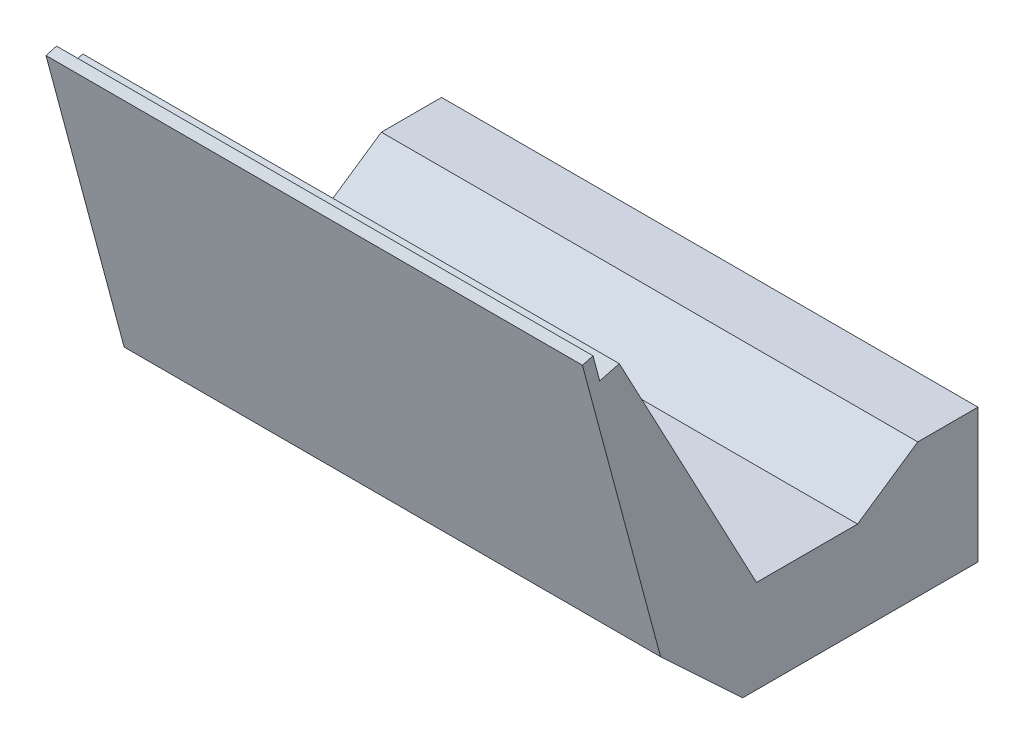
ISO-10303-21;
HEADER;
FILE_DESCRIPTION(('STEP AP214'),'2;1');
FILE_NAME('part.step','',(''),(''),'','','');
FILE_SCHEMA(('AUTOMOTIVE_DESIGN { 1 0 10303 214 1 1 1 1 }'));
ENDSEC;
DATA;
#1=APPLICATION_CONTEXT('core data for automotive mechanical design processes');
#2=APPLICATION_PROTOCOL_DEFINITION('international standard','automotive_design',2000,#1);
#3=PRODUCT_CONTEXT('',#1,'mechanical');
#4=PRODUCT('Part','Part','',(#3));
#5=PRODUCT_RELATED_PRODUCT_CATEGORY('part','',(#4));
#6=PRODUCT_DEFINITION_FORMATION('','',#4);
#7=PRODUCT_DEFINITION_CONTEXT('part definition',#1,'design');
#8=PRODUCT_DEFINITION('design','',#6,#7);
#9=PRODUCT_DEFINITION_SHAPE('','',#8);
#10=(LENGTH_UNIT() NAMED_UNIT(*) SI_UNIT(.MILLI.,.METRE.));
#11=(NAMED_UNIT(*) PLANE_ANGLE_UNIT() SI_UNIT($,.RADIAN.));
#12=(NAMED_UNIT(*) SI_UNIT($,.STERADIAN.) SOLID_ANGLE_UNIT());
#13=UNCERTAINTY_MEASURE_WITH_UNIT(LENGTH_MEASURE(1.E-05),#10,'distance_accuracy_value','');
#14=(GEOMETRIC_REPRESENTATION_CONTEXT(3) GLOBAL_UNCERTAINTY_ASSIGNED_CONTEXT((#13)) GLOBAL_UNIT_ASSIGNED_CONTEXT((#10,
#11,#12)) REPRESENTATION_CONTEXT('',''));
#15=CARTESIAN_POINT('',(0.,0.,0.));
#16=DIRECTION('',(0.,0.,1.));
#17=DIRECTION('',(1.,0.,0.));
#18=AXIS2_PLACEMENT_3D('',#15,#16,#17);
#19=CARTESIAN_POINT('',(49.,6.51622002820874,4.4428772919605));
#20=DIRECTION('',(0.,-0.826227342807548,-0.56333682464151));
#21=DIRECTION('',(0.,0.56333682464151,-0.826227342807548));
#22=AXIS2_PLACEMENT_3D('',#19,#20,#21);
#23=PLANE('',#22);
#24=DIRECTION('',(0.,-0.56333682464151,0.826227342807548));
#25=VECTOR('',#24,1.);
#26=CARTESIAN_POINT('',(-49.,6.51622002820874,4.4428772919605));
#27=LINE('',#26,#25);
#28=CARTESIAN_POINT('',(-49.,7.50000000000001,2.99999999999998));
#29=VERTEX_POINT('',#28);
#30=CARTESIAN_POINT('',(-49.,0.,14.));
#31=VERTEX_POINT('',#30);
#32=EDGE_CURVE('E153',#29,#31,#27,.T.);
#33=ORIENTED_EDGE('',*,*,#32,.T.);
#34=DIRECTION('',(-1.,0.,0.));
#35=VECTOR('',#34,1.);
#36=CARTESIAN_POINT('',(49.,0.,14.));
#37=LINE('',#36,#35);
#38=CARTESIAN_POINT('',(49.,0.,14.));
#39=VERTEX_POINT('',#38);
#40=EDGE_CURVE('E11',#39,#31,#37,.T.);
#41=ORIENTED_EDGE('',*,*,#40,.F.);
#42=DIRECTION('',(0.,-0.56333682464151,0.826227342807548));
#43=VECTOR('',#42,1.);
#44=CARTESIAN_POINT('',(49.,6.51622002820874,4.4428772919605));
#45=LINE('',#44,#43);
#46=CARTESIAN_POINT('',(49.,7.50000000000001,2.99999999999998));
#47=VERTEX_POINT('',#46);
#48=EDGE_CURVE('E179',#47,#39,#45,.T.);
#49=ORIENTED_EDGE('',*,*,#48,.F.);
#50=DIRECTION('',(-1.,0.,0.));
#51=VECTOR('',#50,1.);
#52=CARTESIAN_POINT('',(49.,7.50000000000001,2.99999999999998));
#53=LINE('',#52,#51);
#54=EDGE_CURVE('E152',#47,#29,#53,.T.);
#55=ORIENTED_EDGE('',*,*,#54,.T.);
#56=EDGE_LOOP('',(#33,#41,#49,#55));
#57=FACE_BOUND('',#56,.T.);
#58=ADVANCED_FACE('F38',(#57),#23,.F.);
#59=CARTESIAN_POINT('',(49.,0.,0.));
#60=DIRECTION('',(0.,-1.,0.));
#61=DIRECTION('',(0.,0.,-1.));
#62=AXIS2_PLACEMENT_3D('',#59,#60,#61);
#63=PLANE('',#62);
#64=DIRECTION('',(0.,0.,1.));
#65=VECTOR('',#64,1.);
#66=CARTESIAN_POINT('',(-49.,0.,0.));
#67=LINE('',#66,#65);
#68=CARTESIAN_POINT('',(-49.,0.,32.4672536867458));
#69=VERTEX_POINT('',#68);
#70=EDGE_CURVE('E156',#31,#69,#67,.T.);
#71=ORIENTED_EDGE('',*,*,#70,.T.);
#72=DIRECTION('',(-1.,0.,0.));
#73=VECTOR('',#72,1.);
#74=CARTESIAN_POINT('',(49.,0.,32.4672536867458));
#75=LINE('',#74,#73);
#76=CARTESIAN_POINT('',(49.,0.,32.4672536867458));
#77=VERTEX_POINT('',#76);
#78=EDGE_CURVE('E46',#77,#69,#75,.T.);
#79=ORIENTED_EDGE('',*,*,#78,.F.);
#80=DIRECTION('',(0.,0.,1.));
#81=VECTOR('',#80,1.);
#82=CARTESIAN_POINT('',(49.,0.,0.));
#83=LINE('',#82,#81);
#84=EDGE_CURVE('E105',#39,#77,#83,.T.);
#85=ORIENTED_EDGE('',*,*,#84,.F.);
#86=ORIENTED_EDGE('',*,*,#40,.T.);
#87=EDGE_LOOP('',(#71,#79,#85,#86));
#88=FACE_BOUND('',#87,.T.);
#89=ADVANCED_FACE('F199',(#88),#63,.F.);
#90=CARTESIAN_POINT('',(49.,-13.458286591994,25.3113557717795));
#91=DIRECTION('',(0.,0.469471562785882,-0.882947592858932));
#92=DIRECTION('',(0.,0.882947592858932,0.469471562785882));
#93=AXIS2_PLACEMENT_3D('',#90,#91,#92);
#94=PLANE('',#93);
#95=DIRECTION('',(0.,-0.882947592858932,-0.469471562785882));
#96=VECTOR('',#95,1.);
#97=CARTESIAN_POINT('',(-49.,-13.458286591994,25.3113557717795));
#98=LINE('',#97,#96);
#99=CARTESIAN_POINT('',(-49.,47.1501693405449,57.5374434295488));
#100=VERTEX_POINT('',#99);
#101=EDGE_CURVE('E159',#100,#69,#98,.T.);
#102=ORIENTED_EDGE('',*,*,#101,.F.);
#103=DIRECTION('',(-1.,0.,0.));
#104=VECTOR('',#103,1.);
#105=CARTESIAN_POINT('',(49.,47.1501693405449,57.5374434295488));
#106=LINE('',#105,#104);
#107=CARTESIAN_POINT('',(49.,47.1501693405449,57.5374434295488));
#108=VERTEX_POINT('',#107);
#109=EDGE_CURVE('E192',#108,#100,#106,.T.);
#110=ORIENTED_EDGE('',*,*,#109,.F.);
#111=DIRECTION('',(0.,-0.882947592858932,-0.469471562785882));
#112=VECTOR('',#111,1.);
#113=CARTESIAN_POINT('',(49.,-13.458286591994,25.3113557717795));
#114=LINE('',#113,#112);
#115=EDGE_CURVE('E198',#108,#77,#114,.T.);
#116=ORIENTED_EDGE('',*,*,#115,.T.);
#117=ORIENTED_EDGE('',*,*,#78,.T.);
#118=EDGE_LOOP('',(#102,#110,#116,#117));
#119=FACE_BOUND('',#118,.T.);
#120=ADVANCED_FACE('F196',(#119),#94,.T.);
#121=CARTESIAN_POINT('',(49.,58.3760677484846,15.6418202105109));
#122=DIRECTION('',(0.,0.965925826289069,0.25881904510252));
#123=DIRECTION('',(0.,-0.25881904510252,0.965925826289069));
#124=AXIS2_PLACEMENT_3D('',#121,#122,#123);
#125=PLANE('',#124);
#126=DIRECTION('',(0.,0.25881904510252,-0.965925826289069));
#127=VECTOR('',#126,1.);
#128=CARTESIAN_POINT('',(-49.,58.3760677484846,15.6418202105109));
#129=LINE('',#128,#127);
#130=CARTESIAN_POINT('',(-49.,46.1947859176464,61.102982904515));
#131=VERTEX_POINT('',#130);
#132=EDGE_CURVE('E162',#131,#100,#129,.T.);
#133=ORIENTED_EDGE('',*,*,#132,.F.);
#134=DIRECTION('',(-1.,0.,0.));
#135=VECTOR('',#134,1.);
#136=CARTESIAN_POINT('',(49.,46.1947859176464,61.102982904515));
#137=LINE('',#136,#135);
#138=CARTESIAN_POINT('',(49.,46.1947859176464,61.102982904515));
#139=VERTEX_POINT('',#138);
#140=EDGE_CURVE('E190',#139,#131,#137,.T.);
#141=ORIENTED_EDGE('',*,*,#140,.F.);
#142=DIRECTION('',(0.,0.25881904510252,-0.965925826289069));
#143=VECTOR('',#142,1.);
#144=CARTESIAN_POINT('',(49.,58.3760677484846,15.6418202105109));
#145=LINE('',#144,#143);
#146=EDGE_CURVE('E210',#139,#108,#145,.T.);
#147=ORIENTED_EDGE('',*,*,#146,.T.);
#148=ORIENTED_EDGE('',*,*,#109,.T.);
#149=EDGE_LOOP('',(#133,#141,#147,#148));
#150=FACE_BOUND('',#149,.T.);
#151=ADVANCED_FACE('F207',(#150),#125,.T.);
#152=CARTESIAN_POINT('',(49.,-12.1812818308383,45.4611626940041));
#153=DIRECTION('',(0.,0.258819045102521,-0.965925826289068));
#154=DIRECTION('',(0.,0.965925826289068,0.258819045102521));
#155=AXIS2_PLACEMENT_3D('',#152,#153,#154);
#156=PLANE('',#155);
#157=DIRECTION('',(0.,-0.965925826289068,-0.258819045102521));
#158=VECTOR('',#157,1.);
#159=CARTESIAN_POINT('',(-49.,-12.1812818308383,45.4611626940041));
#160=LINE('',#159,#158);
#161=CARTESIAN_POINT('',(-49.,50.7829335925196,62.332373368752));
#162=VERTEX_POINT('',#161);
#163=EDGE_CURVE('E165',#162,#131,#160,.T.);
#164=ORIENTED_EDGE('',*,*,#163,.F.);
#165=DIRECTION('',(-1.,0.,0.));
#166=VECTOR('',#165,1.);
#167=CARTESIAN_POINT('',(49.,50.7829335925196,62.332373368752));
#168=LINE('',#167,#166);
#169=CARTESIAN_POINT('',(49.,50.7829335925196,62.332373368752));
#170=VERTEX_POINT('',#169);
#171=EDGE_CURVE('E188',#170,#162,#168,.T.);
#172=ORIENTED_EDGE('',*,*,#171,.F.);
#173=DIRECTION('',(0.,-0.965925826289068,-0.258819045102521));
#174=VECTOR('',#173,1.);
#175=CARTESIAN_POINT('',(49.,-12.1812818308383,45.4611626940041));
#176=LINE('',#175,#174);
#177=EDGE_CURVE('E214',#170,#139,#176,.T.);
#178=ORIENTED_EDGE('',*,*,#177,.T.);
#179=ORIENTED_EDGE('',*,*,#140,.T.);
#180=EDGE_LOOP('',(#164,#172,#178,#179));
#181=FACE_BOUND('',#180,.T.);
#182=ADVANCED_FACE('F254',(#181),#156,.T.);
#183=CARTESIAN_POINT('',(49.,62.9642154233577,16.8712106747477));
#184=DIRECTION('',(0.,0.965925826289069,0.258819045102517));
#185=DIRECTION('',(0.,-0.258819045102517,0.965925826289069));
#186=AXIS2_PLACEMENT_3D('',#183,#184,#185);
#187=PLANE('',#186);
#188=DIRECTION('',(0.,0.258819045102517,-0.965925826289069));
#189=VECTOR('',#188,1.);
#190=CARTESIAN_POINT('',(-49.,62.9642154233577,16.8712106747477));
#191=LINE('',#190,#189);
#192=CARTESIAN_POINT('',(-49.,50.2652955023145,64.2642250213302));
#193=VERTEX_POINT('',#192);
#194=EDGE_CURVE('E168',#193,#162,#191,.T.);
#195=ORIENTED_EDGE('',*,*,#194,.F.);
#196=DIRECTION('',(-1.,0.,0.));
#197=VECTOR('',#196,1.);
#198=CARTESIAN_POINT('',(49.,50.2652955023145,64.2642250213302));
#199=LINE('',#198,#197);
#200=CARTESIAN_POINT('',(49.,50.2652955023145,64.2642250213302));
#201=VERTEX_POINT('',#200);
#202=EDGE_CURVE('E186',#201,#193,#199,.T.);
#203=ORIENTED_EDGE('',*,*,#202,.F.);
#204=DIRECTION('',(0.,0.258819045102517,-0.965925826289069));
#205=VECTOR('',#204,1.);
#206=CARTESIAN_POINT('',(49.,62.9642154233577,16.8712106747477));
#207=LINE('',#206,#205);
#208=EDGE_CURVE('E220',#201,#170,#207,.T.);
#209=ORIENTED_EDGE('',*,*,#208,.T.);
#210=ORIENTED_EDGE('',*,*,#171,.T.);
#211=EDGE_LOOP('',(#195,#203,#209,#210));
#212=FACE_BOUND('',#211,.T.);
#213=ADVANCED_FACE('F257',(#212),#187,.T.);
#214=CARTESIAN_POINT('',(49.,-12.6989199210433,47.3930143465824));
#215=DIRECTION('',(0.,0.258819045102518,-0.965925826289069));
#216=DIRECTION('',(0.,0.965925826289069,0.258819045102519));
#217=AXIS2_PLACEMENT_3D('',#214,#215,#216);
#218=PLANE('',#217);
#219=DIRECTION('',(0.,-0.965925826289069,-0.258819045102519));
#220=VECTOR('',#219,1.);
#221=CARTESIAN_POINT('',(-49.,-12.6989199210433,47.3930143465824));
#222=LINE('',#221,#220);
#223=CARTESIAN_POINT('',(-49.,-3.00000000000001,49.9918321068801));
#224=VERTEX_POINT('',#223);
#225=EDGE_CURVE('E171',#193,#224,#222,.T.);
#226=ORIENTED_EDGE('',*,*,#225,.T.);
#227=DIRECTION('',(-1.,0.,0.));
#228=VECTOR('',#227,1.);
#229=CARTESIAN_POINT('',(49.,-3.00000000000001,49.9918321068801));
#230=LINE('',#229,#228);
#231=CARTESIAN_POINT('',(49.,-3.00000000000001,49.9918321068801));
#232=VERTEX_POINT('',#231);
#233=EDGE_CURVE('E183',#232,#224,#230,.T.);
#234=ORIENTED_EDGE('',*,*,#233,.F.);
#235=DIRECTION('',(0.,-0.965925826289069,-0.258819045102519));
#236=VECTOR('',#235,1.);
#237=CARTESIAN_POINT('',(49.,-12.6989199210433,47.3930143465824));
#238=LINE('',#237,#236);
#239=EDGE_CURVE('E147',#201,#232,#238,.T.);
#240=ORIENTED_EDGE('',*,*,#239,.F.);
#241=ORIENTED_EDGE('',*,*,#202,.T.);
#242=EDGE_LOOP('',(#226,#234,#240,#241));
#243=FACE_BOUND('',#242,.T.);
#244=ADVANCED_FACE('F226',(#243),#218,.F.);
#245=CARTESIAN_POINT('',(49.,-26.539987515125,24.7841506336796));
#246=DIRECTION('',(0.,0.730869858491744,-0.682516849570952));
#247=DIRECTION('',(0.,0.682516849570952,0.730869858491744));
#248=AXIS2_PLACEMENT_3D('',#245,#246,#247);
#249=PLANE('',#248);
#250=DIRECTION('',(0.,-0.682516849570952,-0.730869858491744));
#251=VECTOR('',#250,1.);
#252=CARTESIAN_POINT('',(-49.,-26.539987515125,24.7841506336796));
#253=LINE('',#252,#251);
#254=CARTESIAN_POINT('',(-49.,-17.,35.));
#255=VERTEX_POINT('',#254);
#256=EDGE_CURVE('E173',#224,#255,#253,.T.);
#257=ORIENTED_EDGE('',*,*,#256,.T.);
#258=DIRECTION('',(-1.,0.,0.));
#259=VECTOR('',#258,1.);
#260=CARTESIAN_POINT('',(49.,-17.,35.));
#261=LINE('',#260,#259);
#262=CARTESIAN_POINT('',(49.,-17.,35.));
#263=VERTEX_POINT('',#262);
#264=EDGE_CURVE('E136',#263,#255,#261,.T.);
#265=ORIENTED_EDGE('',*,*,#264,.F.);
#266=DIRECTION('',(0.,-0.682516849570952,-0.730869858491744));
#267=VECTOR('',#266,1.);
#268=CARTESIAN_POINT('',(49.,-26.539987515125,24.7841506336796));
#269=LINE('',#268,#267);
#270=EDGE_CURVE('E144',#232,#263,#269,.T.);
#271=ORIENTED_EDGE('',*,*,#270,.F.);
#272=ORIENTED_EDGE('',*,*,#233,.T.);
#273=EDGE_LOOP('',(#257,#265,#271,#272));
#274=FACE_BOUND('',#273,.T.);
#275=ADVANCED_FACE('F230',(#274),#249,.F.);
#276=CARTESIAN_POINT('',(49.,-17.,0.));
#277=DIRECTION('',(0.,-1.,0.));
#278=DIRECTION('',(0.,0.,-1.));
#279=AXIS2_PLACEMENT_3D('',#276,#277,#278);
#280=PLANE('',#279);
#281=DIRECTION('',(0.,0.,1.));
#282=VECTOR('',#281,1.);
#283=CARTESIAN_POINT('',(-49.,-17.,0.));
#284=LINE('',#283,#282);
#285=CARTESIAN_POINT('',(-49.,-17.,-8.));
#286=VERTEX_POINT('',#285);
#287=EDGE_CURVE('E135',#286,#255,#284,.T.);
#288=ORIENTED_EDGE('',*,*,#287,.F.);
#289=DIRECTION('',(-1.,0.,0.));
#290=VECTOR('',#289,1.);
#291=CARTESIAN_POINT('',(49.,-17.,-8.));
#292=LINE('',#291,#290);
#293=CARTESIAN_POINT('',(49.,-17.,-8.));
#294=VERTEX_POINT('',#293);
#295=EDGE_CURVE('E129',#294,#286,#292,.T.);
#296=ORIENTED_EDGE('',*,*,#295,.F.);
#297=DIRECTION('',(0.,0.,1.));
#298=VECTOR('',#297,1.);
#299=CARTESIAN_POINT('',(49.,-17.,0.));
#300=LINE('',#299,#298);
#301=EDGE_CURVE('E133',#294,#263,#300,.T.);
#302=ORIENTED_EDGE('',*,*,#301,.T.);
#303=ORIENTED_EDGE('',*,*,#264,.T.);
#304=EDGE_LOOP('',(#288,#296,#302,#303));
#305=FACE_BOUND('',#304,.T.);
#306=ADVANCED_FACE('F131',(#305),#280,.T.);
#307=CARTESIAN_POINT('',(49.,0.,-8.));
#308=DIRECTION('',(0.,0.,1.));
#309=DIRECTION('',(0.,-1.,0.));
#310=AXIS2_PLACEMENT_3D('',#307,#308,#309);
#311=PLANE('',#310);
#312=DIRECTION('',(0.,1.,0.));
#313=VECTOR('',#312,1.);
#314=CARTESIAN_POINT('',(-49.,0.,-8.));
#315=LINE('',#314,#313);
#316=CARTESIAN_POINT('',(-49.,7.50000000000001,-8.));
#317=VERTEX_POINT('',#316);
#318=EDGE_CURVE('E91',#286,#317,#315,.T.);
#319=ORIENTED_EDGE('',*,*,#318,.T.);
#320=DIRECTION('',(-1.,0.,0.));
#321=VECTOR('',#320,1.);
#322=CARTESIAN_POINT('',(49.,7.50000000000001,-8.));
#323=LINE('',#322,#321);
#324=CARTESIAN_POINT('',(49.,7.50000000000001,-8.));
#325=VERTEX_POINT('',#324);
#326=EDGE_CURVE('E137',#325,#317,#323,.T.);
#327=ORIENTED_EDGE('',*,*,#326,.F.);
#328=DIRECTION('',(0.,1.,0.));
#329=VECTOR('',#328,1.);
#330=CARTESIAN_POINT('',(49.,0.,-8.));
#331=LINE('',#330,#329);
#332=EDGE_CURVE('E139',#294,#325,#331,.T.);
#333=ORIENTED_EDGE('',*,*,#332,.F.);
#334=ORIENTED_EDGE('',*,*,#295,.T.);
#335=EDGE_LOOP('',(#319,#327,#333,#334));
#336=FACE_BOUND('',#335,.T.);
#337=ADVANCED_FACE('F140',(#336),#311,.F.);
#338=CARTESIAN_POINT('',(49.,7.50000000000001,0.));
#339=DIRECTION('',(0.,-1.,0.));
#340=DIRECTION('',(0.,0.,-1.));
#341=AXIS2_PLACEMENT_3D('',#338,#339,#340);
#342=PLANE('',#341);
#343=DIRECTION('',(0.,0.,1.));
#344=VECTOR('',#343,1.);
#345=CARTESIAN_POINT('',(-49.,7.50000000000001,0.));
#346=LINE('',#345,#344);
#347=EDGE_CURVE('E97',#317,#29,#346,.T.);
#348=ORIENTED_EDGE('',*,*,#347,.T.);
#349=ORIENTED_EDGE('',*,*,#54,.F.);
#350=DIRECTION('',(0.,0.,1.));
#351=VECTOR('',#350,1.);
#352=CARTESIAN_POINT('',(49.,7.50000000000001,0.));
#353=LINE('',#352,#351);
#354=EDGE_CURVE('E54',#325,#47,#353,.T.);
#355=ORIENTED_EDGE('',*,*,#354,.F.);
#356=ORIENTED_EDGE('',*,*,#326,.T.);
#357=EDGE_LOOP('',(#348,#349,#355,#356));
#358=FACE_BOUND('',#357,.T.);
#359=ADVANCED_FACE('F233',(#358),#342,.F.);
#360=CARTESIAN_POINT('',(49.,0.,0.));
#361=DIRECTION('',(1.,0.,0.));
#362=DIRECTION('',(0.,0.,-1.));
#363=AXIS2_PLACEMENT_3D('',#360,#361,#362);
#364=PLANE('',#363);
#365=ORIENTED_EDGE('',*,*,#48,.T.);
#366=ORIENTED_EDGE('',*,*,#84,.T.);
#367=ORIENTED_EDGE('',*,*,#115,.F.);
#368=ORIENTED_EDGE('',*,*,#146,.F.);
#369=ORIENTED_EDGE('',*,*,#177,.F.);
#370=ORIENTED_EDGE('',*,*,#208,.F.);
#371=ORIENTED_EDGE('',*,*,#239,.T.);
#372=ORIENTED_EDGE('',*,*,#270,.T.);
#373=ORIENTED_EDGE('',*,*,#301,.F.);
#374=ORIENTED_EDGE('',*,*,#332,.T.);
#375=ORIENTED_EDGE('',*,*,#354,.T.);
#376=EDGE_LOOP('',(#365,#366,#367,#368,#369,#370,#371,#372,#373,#374,#375));
#377=FACE_BOUND('',#376,.T.);
#378=ADVANCED_FACE('F142',(#377),#364,.T.);
#379=CARTESIAN_POINT('',(-49.,0.,0.));
#380=DIRECTION('',(1.,0.,0.));
#381=DIRECTION('',(0.,0.,-1.));
#382=AXIS2_PLACEMENT_3D('',#379,#380,#381);
#383=PLANE('',#382);
#384=ORIENTED_EDGE('',*,*,#32,.F.);
#385=ORIENTED_EDGE('',*,*,#347,.F.);
#386=ORIENTED_EDGE('',*,*,#318,.F.);
#387=ORIENTED_EDGE('',*,*,#287,.T.);
#388=ORIENTED_EDGE('',*,*,#256,.F.);
#389=ORIENTED_EDGE('',*,*,#225,.F.);
#390=ORIENTED_EDGE('',*,*,#194,.T.);
#391=ORIENTED_EDGE('',*,*,#163,.T.);
#392=ORIENTED_EDGE('',*,*,#132,.T.);
#393=ORIENTED_EDGE('',*,*,#101,.T.);
#394=ORIENTED_EDGE('',*,*,#70,.F.);
#395=EDGE_LOOP('',(#384,#385,#386,#387,#388,#389,#390,#391,#392,#393,#394));
#396=FACE_BOUND('',#395,.T.);
#397=ADVANCED_FACE('F203',(#396),#383,.F.);
#398=CLOSED_SHELL('',(#58,#89,#120,#151,#182,#213,#244,#275,#306,#337,#359,#378,#397));
#399=MANIFOLD_SOLID_BREP('B2',#398);
#400=ADVANCED_BREP_SHAPE_REPRESENTATION('',(#18,#399),#14);
#401=SHAPE_DEFINITION_REPRESENTATION(#9,#400);
ENDSEC;
END-ISO-10303-21;
